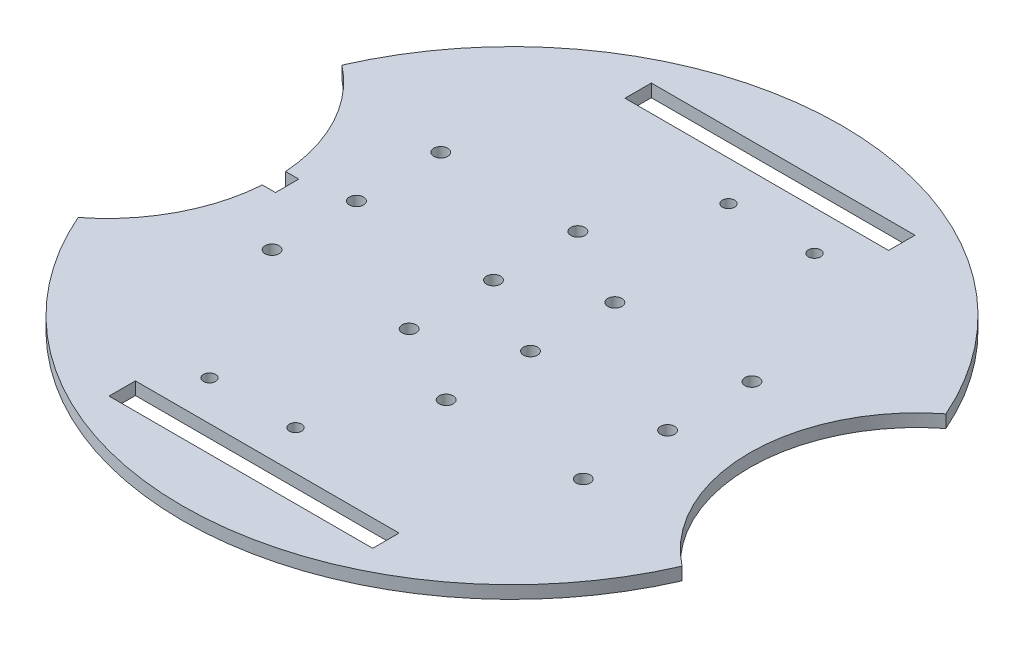
ISO-10303-21;
HEADER;
FILE_DESCRIPTION(('STEP AP214'),'2;1');
FILE_NAME('part.step','',(''),(''),'','','');
FILE_SCHEMA(('AUTOMOTIVE_DESIGN { 1 0 10303 214 1 1 1 1 }'));
ENDSEC;
DATA;
#1=APPLICATION_CONTEXT('core data for automotive mechanical design processes');
#2=APPLICATION_PROTOCOL_DEFINITION('international standard','automotive_design',2000,#1);
#3=PRODUCT_CONTEXT('',#1,'mechanical');
#4=PRODUCT('Part','Part','',(#3));
#5=PRODUCT_RELATED_PRODUCT_CATEGORY('part','',(#4));
#6=PRODUCT_DEFINITION_FORMATION('','',#4);
#7=PRODUCT_DEFINITION_CONTEXT('part definition',#1,'design');
#8=PRODUCT_DEFINITION('design','',#6,#7);
#9=PRODUCT_DEFINITION_SHAPE('','',#8);
#10=(LENGTH_UNIT() NAMED_UNIT(*) SI_UNIT(.MILLI.,.METRE.));
#11=(NAMED_UNIT(*) PLANE_ANGLE_UNIT() SI_UNIT($,.RADIAN.));
#12=(NAMED_UNIT(*) SI_UNIT($,.STERADIAN.) SOLID_ANGLE_UNIT());
#13=UNCERTAINTY_MEASURE_WITH_UNIT(LENGTH_MEASURE(1.E-05),#10,'distance_accuracy_value','');
#14=(GEOMETRIC_REPRESENTATION_CONTEXT(3) GLOBAL_UNCERTAINTY_ASSIGNED_CONTEXT((#13)) GLOBAL_UNIT_ASSIGNED_CONTEXT((#10,
#11,#12)) REPRESENTATION_CONTEXT('',''));
#15=CARTESIAN_POINT('',(0.,0.,0.));
#16=DIRECTION('',(0.,0.,1.));
#17=DIRECTION('',(1.,0.,0.));
#18=AXIS2_PLACEMENT_3D('',#15,#16,#17);
#19=CARTESIAN_POINT('',(0.,2.9,0.));
#20=DIRECTION('',(0.,1.,0.));
#21=DIRECTION('',(0.,0.,1.));
#22=AXIS2_PLACEMENT_3D('',#19,#20,#21);
#23=PLANE('',#22);
#24=DIRECTION('',(1.,0.,0.));
#25=VECTOR('',#24,1.);
#26=CARTESIAN_POINT('',(0.,2.9,-61.7092421050368));
#27=LINE('',#26,#25);
#28=CARTESIAN_POINT('',(-30.,2.9,-61.7092421050368));
#29=VERTEX_POINT('',#28);
#30=CARTESIAN_POINT('',(30.,2.9,-61.7092421050368));
#31=VERTEX_POINT('',#30);
#32=EDGE_CURVE('E183',#29,#31,#27,.T.);
#33=ORIENTED_EDGE('',*,*,#32,.T.);
#34=DIRECTION('',(0.,0.,1.));
#35=VECTOR('',#34,1.);
#36=CARTESIAN_POINT('',(30.0000000000001,2.9,0.));
#37=LINE('',#36,#35);
#38=CARTESIAN_POINT('',(30.,2.9,-55.7092421050368));
#39=VERTEX_POINT('',#38);
#40=EDGE_CURVE('E57',#31,#39,#37,.T.);
#41=ORIENTED_EDGE('',*,*,#40,.T.);
#42=DIRECTION('',(1.,0.,0.));
#43=VECTOR('',#42,1.);
#44=CARTESIAN_POINT('',(0.,2.9,-55.7092421050368));
#45=LINE('',#44,#43);
#46=CARTESIAN_POINT('',(-30.,2.9,-55.7092421050368));
#47=VERTEX_POINT('',#46);
#48=EDGE_CURVE('E189',#47,#39,#45,.T.);
#49=ORIENTED_EDGE('',*,*,#48,.F.);
#50=DIRECTION('',(0.,0.,1.));
#51=VECTOR('',#50,1.);
#52=CARTESIAN_POINT('',(-29.9999999999999,2.9,0.));
#53=LINE('',#52,#51);
#54=EDGE_CURVE('E186',#29,#47,#53,.T.);
#55=ORIENTED_EDGE('',*,*,#54,.F.);
#56=EDGE_LOOP('',(#33,#41,#49,#55));
#57=FACE_BOUND('',#56,.T.);
#58=CARTESIAN_POINT('',(-9.0999999999999,2.9,-24.0907578949632));
#59=DIRECTION('',(0.,1.,0.));
#60=DIRECTION('',(0.,0.,1.));
#61=AXIS2_PLACEMENT_3D('',#58,#59,#60);
#62=CIRCLE('',#61,1.6);
#63=CARTESIAN_POINT('',(-9.0999999999999,2.9,-22.4907578949632));
#64=VERTEX_POINT('',#63);
#65=EDGE_CURVE('E249',#64,#64,#62,.F.);
#66=ORIENTED_EDGE('',*,*,#65,.T.);
#67=EDGE_LOOP('',(#66));
#68=FACE_BOUND('',#67,.T.);
#69=CARTESIAN_POINT('',(-9.09999999999995,2.9,-4.89075789496318));
#70=DIRECTION('',(0.,1.,0.));
#71=DIRECTION('',(0.,0.,1.));
#72=AXIS2_PLACEMENT_3D('',#69,#70,#71);
#73=CIRCLE('',#72,1.6);
#74=CARTESIAN_POINT('',(-9.09999999999995,2.9,-3.29075789496318));
#75=VERTEX_POINT('',#74);
#76=EDGE_CURVE('E257',#75,#75,#73,.F.);
#77=ORIENTED_EDGE('',*,*,#76,.T.);
#78=EDGE_LOOP('',(#77));
#79=FACE_BOUND('',#78,.T.);
#80=CARTESIAN_POINT('',(9.10000000000001,2.9,-14.3092421050368));
#81=DIRECTION('',(0.,1.,0.));
#82=DIRECTION('',(0.,0.,1.));
#83=AXIS2_PLACEMENT_3D('',#80,#81,#82);
#84=CIRCLE('',#83,1.6);
#85=CARTESIAN_POINT('',(9.10000000000001,2.9,-12.7092421050368));
#86=VERTEX_POINT('',#85);
#87=EDGE_CURVE('E265',#86,#86,#84,.F.);
#88=ORIENTED_EDGE('',*,*,#87,.T.);
#89=EDGE_LOOP('',(#88));
#90=FACE_BOUND('',#89,.T.);
#91=CARTESIAN_POINT('',(40.3,2.9,-14.3092421050368));
#92=DIRECTION('',(0.,1.,0.));
#93=DIRECTION('',(0.,0.,1.));
#94=AXIS2_PLACEMENT_3D('',#91,#92,#93);
#95=CIRCLE('',#94,1.6);
#96=CARTESIAN_POINT('',(40.3,2.9,-12.7092421050368));
#97=VERTEX_POINT('',#96);
#98=EDGE_CURVE('E269',#97,#97,#95,.T.);
#99=ORIENTED_EDGE('',*,*,#98,.F.);
#100=EDGE_LOOP('',(#99));
#101=FACE_BOUND('',#100,.T.);
#102=CARTESIAN_POINT('',(40.3000000000002,2.9,4.89075789496318));
#103=DIRECTION('',(0.,1.,0.));
#104=DIRECTION('',(0.,0.,1.));
#105=AXIS2_PLACEMENT_3D('',#102,#103,#104);
#106=CIRCLE('',#105,1.6);
#107=CARTESIAN_POINT('',(40.3000000000002,2.9,6.49075789496318));
#108=VERTEX_POINT('',#107);
#109=EDGE_CURVE('E273',#108,#108,#106,.T.);
#110=ORIENTED_EDGE('',*,*,#109,.F.);
#111=EDGE_LOOP('',(#110));
#112=FACE_BOUND('',#111,.T.);
#113=CARTESIAN_POINT('',(40.3000000000004,2.9,24.0907578949632));
#114=DIRECTION('',(0.,1.,0.));
#115=DIRECTION('',(0.,0.,1.));
#116=AXIS2_PLACEMENT_3D('',#113,#114,#115);
#117=CIRCLE('',#116,1.6);
#118=CARTESIAN_POINT('',(40.3000000000004,2.9,25.6907578949632));
#119=VERTEX_POINT('',#118);
#120=EDGE_CURVE('E277',#119,#119,#117,.T.);
#121=ORIENTED_EDGE('',*,*,#120,.F.);
#122=EDGE_LOOP('',(#121));
#123=FACE_BOUND('',#122,.T.);
#124=CARTESIAN_POINT('',(9.09999999999963,2.9,24.0907578949632));
#125=DIRECTION('',(0.,1.,0.));
#126=DIRECTION('',(0.,0.,1.));
#127=AXIS2_PLACEMENT_3D('',#124,#125,#126);
#128=CIRCLE('',#127,1.6);
#129=CARTESIAN_POINT('',(9.09999999999963,2.9,25.6907578949632));
#130=VERTEX_POINT('',#129);
#131=EDGE_CURVE('E281',#130,#130,#128,.F.);
#132=ORIENTED_EDGE('',*,*,#131,.T.);
#133=EDGE_LOOP('',(#132));
#134=FACE_BOUND('',#133,.T.);
#135=CARTESIAN_POINT('',(9.09999999999982,2.9,4.89075789496319));
#136=DIRECTION('',(0.,1.,0.));
#137=DIRECTION('',(0.,0.,1.));
#138=AXIS2_PLACEMENT_3D('',#135,#136,#137);
#139=CIRCLE('',#138,1.6);
#140=CARTESIAN_POINT('',(9.09999999999982,2.9,6.49075789496319));
#141=VERTEX_POINT('',#140);
#142=EDGE_CURVE('E261',#141,#141,#139,.F.);
#143=ORIENTED_EDGE('',*,*,#142,.T.);
#144=EDGE_LOOP('',(#143));
#145=FACE_BOUND('',#144,.T.);
#146=CARTESIAN_POINT('',(-9.10000000000001,2.9,14.3092421050368));
#147=DIRECTION('',(0.,1.,0.));
#148=DIRECTION('',(0.,0.,1.));
#149=AXIS2_PLACEMENT_3D('',#146,#147,#148);
#150=CIRCLE('',#149,1.6);
#151=CARTESIAN_POINT('',(-9.10000000000001,2.9,15.9092421050368));
#152=VERTEX_POINT('',#151);
#153=EDGE_CURVE('E253',#152,#152,#150,.F.);
#154=ORIENTED_EDGE('',*,*,#153,.T.);
#155=EDGE_LOOP('',(#154));
#156=FACE_BOUND('',#155,.T.);
#157=CARTESIAN_POINT('',(-40.3000000000001,2.9,-24.0907578949632));
#158=DIRECTION('',(0.,1.,0.));
#159=DIRECTION('',(0.,0.,1.));
#160=AXIS2_PLACEMENT_3D('',#157,#158,#159);
#161=CIRCLE('',#160,1.6);
#162=CARTESIAN_POINT('',(-40.3000000000001,2.9,-22.4907578949632));
#163=VERTEX_POINT('',#162);
#164=EDGE_CURVE('E245',#163,#163,#161,.T.);
#165=ORIENTED_EDGE('',*,*,#164,.F.);
#166=EDGE_LOOP('',(#165));
#167=FACE_BOUND('',#166,.T.);
#168=CARTESIAN_POINT('',(-40.3000000000001,2.9,-4.89075789496317));
#169=DIRECTION('',(0.,1.,0.));
#170=DIRECTION('',(0.,0.,1.));
#171=AXIS2_PLACEMENT_3D('',#168,#169,#170);
#172=CIRCLE('',#171,1.6);
#173=CARTESIAN_POINT('',(-40.3000000000001,2.9,-3.29075789496317));
#174=VERTEX_POINT('',#173);
#175=EDGE_CURVE('E241',#174,#174,#172,.T.);
#176=ORIENTED_EDGE('',*,*,#175,.F.);
#177=EDGE_LOOP('',(#176));
#178=FACE_BOUND('',#177,.T.);
#179=CARTESIAN_POINT('',(-40.3,2.9,14.3092421050368));
#180=DIRECTION('',(0.,1.,0.));
#181=DIRECTION('',(0.,0.,1.));
#182=AXIS2_PLACEMENT_3D('',#179,#180,#181);
#183=CIRCLE('',#182,1.6);
#184=CARTESIAN_POINT('',(-40.3,2.9,15.9092421050368));
#185=VERTEX_POINT('',#184);
#186=EDGE_CURVE('E237',#185,#185,#183,.T.);
#187=ORIENTED_EDGE('',*,*,#186,.F.);
#188=EDGE_LOOP('',(#187));
#189=FACE_BOUND('',#188,.T.);
#190=CARTESIAN_POINT('',(-22.14,2.9,46.7092421050368));
#191=DIRECTION('',(0.,1.,0.));
#192=DIRECTION('',(0.,0.,1.));
#193=AXIS2_PLACEMENT_3D('',#190,#191,#192);
#194=CIRCLE('',#193,1.4);
#195=CARTESIAN_POINT('',(-22.14,2.9,48.1092421050368));
#196=VERTEX_POINT('',#195);
#197=EDGE_CURVE('E233',#196,#196,#194,.T.);
#198=ORIENTED_EDGE('',*,*,#197,.F.);
#199=EDGE_LOOP('',(#198));
#200=FACE_BOUND('',#199,.T.);
#201=CARTESIAN_POINT('',(-2.56,2.9,46.7092421050368));
#202=DIRECTION('',(0.,1.,0.));
#203=DIRECTION('',(0.,0.,1.));
#204=AXIS2_PLACEMENT_3D('',#201,#202,#203);
#205=CIRCLE('',#204,1.4);
#206=CARTESIAN_POINT('',(-2.56,2.9,48.1092421050368));
#207=VERTEX_POINT('',#206);
#208=EDGE_CURVE('E229',#207,#207,#205,.T.);
#209=ORIENTED_EDGE('',*,*,#208,.F.);
#210=EDGE_LOOP('',(#209));
#211=FACE_BOUND('',#210,.T.);
#212=CARTESIAN_POINT('',(22.14,2.9,-46.7092421050368));
#213=DIRECTION('',(0.,1.,0.));
#214=DIRECTION('',(0.,0.,1.));
#215=AXIS2_PLACEMENT_3D('',#212,#213,#214);
#216=CIRCLE('',#215,1.4);
#217=CARTESIAN_POINT('',(22.14,2.9,-45.3092421050368));
#218=VERTEX_POINT('',#217);
#219=EDGE_CURVE('E225',#218,#218,#216,.T.);
#220=ORIENTED_EDGE('',*,*,#219,.F.);
#221=EDGE_LOOP('',(#220));
#222=FACE_BOUND('',#221,.T.);
#223=CARTESIAN_POINT('',(2.56,2.9,-46.7092421050368));
#224=DIRECTION('',(0.,1.,0.));
#225=DIRECTION('',(0.,0.,1.));
#226=AXIS2_PLACEMENT_3D('',#223,#224,#225);
#227=CIRCLE('',#226,1.4);
#228=CARTESIAN_POINT('',(2.56,2.9,-45.3092421050368));
#229=VERTEX_POINT('',#228);
#230=EDGE_CURVE('E215',#229,#229,#227,.T.);
#231=ORIENTED_EDGE('',*,*,#230,.F.);
#232=EDGE_LOOP('',(#231));
#233=FACE_BOUND('',#232,.T.);
#234=DIRECTION('',(1.,0.,0.));
#235=VECTOR('',#234,1.);
#236=CARTESIAN_POINT('',(0.,2.9,55.7092421050368));
#237=LINE('',#236,#235);
#238=CARTESIAN_POINT('',(-30.,2.9,55.7092421050368));
#239=VERTEX_POINT('',#238);
#240=CARTESIAN_POINT('',(30.,2.9,55.7092421050368));
#241=VERTEX_POINT('',#240);
#242=EDGE_CURVE('E203',#239,#241,#237,.T.);
#243=ORIENTED_EDGE('',*,*,#242,.T.);
#244=DIRECTION('',(0.,0.,1.));
#245=VECTOR('',#244,1.);
#246=CARTESIAN_POINT('',(30.,2.9,0.));
#247=LINE('',#246,#245);
#248=CARTESIAN_POINT('',(30.,2.9,61.7092421050368));
#249=VERTEX_POINT('',#248);
#250=EDGE_CURVE('E195',#241,#249,#247,.T.);
#251=ORIENTED_EDGE('',*,*,#250,.T.);
#252=DIRECTION('',(1.,0.,0.));
#253=VECTOR('',#252,1.);
#254=CARTESIAN_POINT('',(0.,2.9,61.7092421050368));
#255=LINE('',#254,#253);
#256=CARTESIAN_POINT('',(-30.,2.9,61.7092421050368));
#257=VERTEX_POINT('',#256);
#258=EDGE_CURVE('E209',#257,#249,#255,.T.);
#259=ORIENTED_EDGE('',*,*,#258,.F.);
#260=DIRECTION('',(0.,0.,1.));
#261=VECTOR('',#260,1.);
#262=CARTESIAN_POINT('',(-29.9999999999999,2.9,0.));
#263=LINE('',#262,#261);
#264=EDGE_CURVE('E206',#239,#257,#263,.T.);
#265=ORIENTED_EDGE('',*,*,#264,.F.);
#266=EDGE_LOOP('',(#243,#251,#259,#265));
#267=FACE_BOUND('',#266,.T.);
#268=CARTESIAN_POINT('',(-92.1852034198443,2.9,0.));
#269=DIRECTION('',(0.,1.,0.));
#270=DIRECTION('',(0.,0.,1.));
#271=AXIS2_PLACEMENT_3D('',#268,#269,#270);
#272=CIRCLE('',#271,38.1);
#273=CARTESIAN_POINT('',(-68.7285012099368,2.9,-30.0232097124162));
#274=VERTEX_POINT('',#273);
#275=CARTESIAN_POINT('',(-54.1774739428024,2.9,-2.65));
#276=VERTEX_POINT('',#275);
#277=EDGE_CURVE('E293',#274,#276,#272,.F.);
#278=ORIENTED_EDGE('',*,*,#277,.T.);
#279=DIRECTION('',(1.,0.,0.));
#280=VECTOR('',#279,1.);
#281=CARTESIAN_POINT('',(0.,2.9,-2.65));
#282=LINE('',#281,#280);
#283=CARTESIAN_POINT('',(-51.1774739428024,2.9,-2.65));
#284=VERTEX_POINT('',#283);
#285=EDGE_CURVE('E168',#276,#284,#282,.T.);
#286=ORIENTED_EDGE('',*,*,#285,.T.);
#287=DIRECTION('',(0.,0.,1.));
#288=VECTOR('',#287,1.);
#289=CARTESIAN_POINT('',(-51.1774739428024,2.9,0.));
#290=LINE('',#289,#288);
#291=CARTESIAN_POINT('',(-51.1774739428024,2.9,2.65));
#292=VERTEX_POINT('',#291);
#293=EDGE_CURVE('E171',#284,#292,#290,.T.);
#294=ORIENTED_EDGE('',*,*,#293,.T.);
#295=DIRECTION('',(-1.,0.,0.));
#296=VECTOR('',#295,1.);
#297=CARTESIAN_POINT('',(0.,2.9,2.65));
#298=LINE('',#297,#296);
#299=CARTESIAN_POINT('',(-54.1774739428024,2.9,2.65));
#300=VERTEX_POINT('',#299);
#301=EDGE_CURVE('E160',#292,#300,#298,.T.);
#302=ORIENTED_EDGE('',*,*,#301,.T.);
#303=CARTESIAN_POINT('',(-68.7285012099368,2.9,30.0232097124162));
#304=VERTEX_POINT('',#303);
#305=EDGE_CURVE('E291',#300,#304,#272,.F.);
#306=ORIENTED_EDGE('',*,*,#305,.T.);
#307=CARTESIAN_POINT('',(0.,2.9,0.));
#308=DIRECTION('',(0.,1.,0.));
#309=DIRECTION('',(0.,0.,1.));
#310=AXIS2_PLACEMENT_3D('',#307,#308,#309);
#311=CIRCLE('',#310,75.);
#312=CARTESIAN_POINT('',(68.7285012099368,2.9,30.0232097124162));
#313=VERTEX_POINT('',#312);
#314=EDGE_CURVE('E303',#304,#313,#311,.T.);
#315=ORIENTED_EDGE('',*,*,#314,.T.);
#316=CARTESIAN_POINT('',(92.1852034198443,2.9,0.));
#317=DIRECTION('',(0.,1.,0.));
#318=DIRECTION('',(0.,0.,1.));
#319=AXIS2_PLACEMENT_3D('',#316,#317,#318);
#320=CIRCLE('',#319,38.1);
#321=CARTESIAN_POINT('',(68.7285012099368,2.9,-30.0232097124162));
#322=VERTEX_POINT('',#321);
#323=EDGE_CURVE('E285',#322,#313,#320,.T.);
#324=ORIENTED_EDGE('',*,*,#323,.F.);
#325=EDGE_CURVE('E306',#322,#274,#311,.T.);
#326=ORIENTED_EDGE('',*,*,#325,.T.);
#327=EDGE_LOOP('',(#278,#286,#294,#302,#306,#315,#324,#326));
#328=FACE_BOUND('',#327,.T.);
#329=ADVANCED_FACE('F34',(#57,#68,#79,#90,#101,#112,#123,#134,#145,#156,#167,#178,#189,#200,
#211,#222,#233,#267,#328),#23,.T.);
#330=CARTESIAN_POINT('',(0.,0.,0.));
#331=DIRECTION('',(0.,1.,0.));
#332=DIRECTION('',(0.,0.,1.));
#333=AXIS2_PLACEMENT_3D('',#330,#331,#332);
#334=PLANE('',#333);
#335=DIRECTION('',(0.,0.,1.));
#336=VECTOR('',#335,1.);
#337=CARTESIAN_POINT('',(30.0000000000001,0.,0.));
#338=LINE('',#337,#336);
#339=CARTESIAN_POINT('',(30.,0.,-61.7092421050368));
#340=VERTEX_POINT('',#339);
#341=CARTESIAN_POINT('',(30.,0.,-55.7092421050368));
#342=VERTEX_POINT('',#341);
#343=EDGE_CURVE('E11',#340,#342,#338,.T.);
#344=ORIENTED_EDGE('',*,*,#343,.F.);
#345=DIRECTION('',(1.,0.,0.));
#346=VECTOR('',#345,1.);
#347=CARTESIAN_POINT('',(0.,0.,-61.7092421050368));
#348=LINE('',#347,#346);
#349=CARTESIAN_POINT('',(-30.,0.,-61.7092421050368));
#350=VERTEX_POINT('',#349);
#351=EDGE_CURVE('E358',#350,#340,#348,.T.);
#352=ORIENTED_EDGE('',*,*,#351,.F.);
#353=DIRECTION('',(0.,0.,1.));
#354=VECTOR('',#353,1.);
#355=CARTESIAN_POINT('',(-29.9999999999999,0.,0.));
#356=LINE('',#355,#354);
#357=CARTESIAN_POINT('',(-30.,0.,-55.7092421050368));
#358=VERTEX_POINT('',#357);
#359=EDGE_CURVE('E360',#350,#358,#356,.T.);
#360=ORIENTED_EDGE('',*,*,#359,.T.);
#361=DIRECTION('',(1.,0.,0.));
#362=VECTOR('',#361,1.);
#363=CARTESIAN_POINT('',(0.,0.,-55.7092421050368));
#364=LINE('',#363,#362);
#365=EDGE_CURVE('E42',#358,#342,#364,.T.);
#366=ORIENTED_EDGE('',*,*,#365,.T.);
#367=EDGE_LOOP('',(#344,#352,#360,#366));
#368=FACE_BOUND('',#367,.T.);
#369=CARTESIAN_POINT('',(-9.0999999999999,0.,-24.0907578949632));
#370=DIRECTION('',(0.,1.,0.));
#371=DIRECTION('',(0.,0.,1.));
#372=AXIS2_PLACEMENT_3D('',#369,#370,#371);
#373=CIRCLE('',#372,1.6);
#374=CARTESIAN_POINT('',(-9.0999999999999,0.,-22.4907578949632));
#375=VERTEX_POINT('',#374);
#376=EDGE_CURVE('E252',#375,#375,#373,.F.);
#377=ORIENTED_EDGE('',*,*,#376,.F.);
#378=EDGE_LOOP('',(#377));
#379=FACE_BOUND('',#378,.T.);
#380=CARTESIAN_POINT('',(-9.09999999999995,0.,-4.89075789496318));
#381=DIRECTION('',(0.,1.,0.));
#382=DIRECTION('',(0.,0.,1.));
#383=AXIS2_PLACEMENT_3D('',#380,#381,#382);
#384=CIRCLE('',#383,1.6);
#385=CARTESIAN_POINT('',(-9.09999999999995,0.,-3.29075789496318));
#386=VERTEX_POINT('',#385);
#387=EDGE_CURVE('E260',#386,#386,#384,.F.);
#388=ORIENTED_EDGE('',*,*,#387,.F.);
#389=EDGE_LOOP('',(#388));
#390=FACE_BOUND('',#389,.T.);
#391=CARTESIAN_POINT('',(9.10000000000001,0.,-14.3092421050368));
#392=DIRECTION('',(0.,1.,0.));
#393=DIRECTION('',(0.,0.,1.));
#394=AXIS2_PLACEMENT_3D('',#391,#392,#393);
#395=CIRCLE('',#394,1.6);
#396=CARTESIAN_POINT('',(9.10000000000001,0.,-12.7092421050368));
#397=VERTEX_POINT('',#396);
#398=EDGE_CURVE('E268',#397,#397,#395,.F.);
#399=ORIENTED_EDGE('',*,*,#398,.F.);
#400=EDGE_LOOP('',(#399));
#401=FACE_BOUND('',#400,.T.);
#402=CARTESIAN_POINT('',(40.3,0.,-14.3092421050368));
#403=DIRECTION('',(0.,1.,0.));
#404=DIRECTION('',(0.,0.,1.));
#405=AXIS2_PLACEMENT_3D('',#402,#403,#404);
#406=CIRCLE('',#405,1.6);
#407=CARTESIAN_POINT('',(40.3,0.,-12.7092421050368));
#408=VERTEX_POINT('',#407);
#409=EDGE_CURVE('E272',#408,#408,#406,.T.);
#410=ORIENTED_EDGE('',*,*,#409,.T.);
#411=EDGE_LOOP('',(#410));
#412=FACE_BOUND('',#411,.T.);
#413=CARTESIAN_POINT('',(40.3000000000002,0.,4.89075789496318));
#414=DIRECTION('',(0.,1.,0.));
#415=DIRECTION('',(0.,0.,1.));
#416=AXIS2_PLACEMENT_3D('',#413,#414,#415);
#417=CIRCLE('',#416,1.6);
#418=CARTESIAN_POINT('',(40.3000000000002,0.,6.49075789496318));
#419=VERTEX_POINT('',#418);
#420=EDGE_CURVE('E276',#419,#419,#417,.T.);
#421=ORIENTED_EDGE('',*,*,#420,.T.);
#422=EDGE_LOOP('',(#421));
#423=FACE_BOUND('',#422,.T.);
#424=CARTESIAN_POINT('',(40.3000000000004,0.,24.0907578949632));
#425=DIRECTION('',(0.,1.,0.));
#426=DIRECTION('',(0.,0.,1.));
#427=AXIS2_PLACEMENT_3D('',#424,#425,#426);
#428=CIRCLE('',#427,1.6);
#429=CARTESIAN_POINT('',(40.3000000000004,0.,25.6907578949632));
#430=VERTEX_POINT('',#429);
#431=EDGE_CURVE('E280',#430,#430,#428,.T.);
#432=ORIENTED_EDGE('',*,*,#431,.T.);
#433=EDGE_LOOP('',(#432));
#434=FACE_BOUND('',#433,.T.);
#435=CARTESIAN_POINT('',(9.09999999999963,0.,24.0907578949632));
#436=DIRECTION('',(0.,1.,0.));
#437=DIRECTION('',(0.,0.,1.));
#438=AXIS2_PLACEMENT_3D('',#435,#436,#437);
#439=CIRCLE('',#438,1.6);
#440=CARTESIAN_POINT('',(9.09999999999963,0.,25.6907578949632));
#441=VERTEX_POINT('',#440);
#442=EDGE_CURVE('E284',#441,#441,#439,.F.);
#443=ORIENTED_EDGE('',*,*,#442,.F.);
#444=EDGE_LOOP('',(#443));
#445=FACE_BOUND('',#444,.T.);
#446=CARTESIAN_POINT('',(9.09999999999982,0.,4.89075789496319));
#447=DIRECTION('',(0.,1.,0.));
#448=DIRECTION('',(0.,0.,1.));
#449=AXIS2_PLACEMENT_3D('',#446,#447,#448);
#450=CIRCLE('',#449,1.6);
#451=CARTESIAN_POINT('',(9.09999999999982,0.,6.49075789496319));
#452=VERTEX_POINT('',#451);
#453=EDGE_CURVE('E264',#452,#452,#450,.F.);
#454=ORIENTED_EDGE('',*,*,#453,.F.);
#455=EDGE_LOOP('',(#454));
#456=FACE_BOUND('',#455,.T.);
#457=CARTESIAN_POINT('',(-9.10000000000001,0.,14.3092421050368));
#458=DIRECTION('',(0.,1.,0.));
#459=DIRECTION('',(0.,0.,1.));
#460=AXIS2_PLACEMENT_3D('',#457,#458,#459);
#461=CIRCLE('',#460,1.6);
#462=CARTESIAN_POINT('',(-9.10000000000001,0.,15.9092421050368));
#463=VERTEX_POINT('',#462);
#464=EDGE_CURVE('E256',#463,#463,#461,.F.);
#465=ORIENTED_EDGE('',*,*,#464,.F.);
#466=EDGE_LOOP('',(#465));
#467=FACE_BOUND('',#466,.T.);
#468=CARTESIAN_POINT('',(-40.3000000000001,0.,-24.0907578949632));
#469=DIRECTION('',(0.,1.,0.));
#470=DIRECTION('',(0.,0.,1.));
#471=AXIS2_PLACEMENT_3D('',#468,#469,#470);
#472=CIRCLE('',#471,1.6);
#473=CARTESIAN_POINT('',(-40.3000000000001,0.,-22.4907578949632));
#474=VERTEX_POINT('',#473);
#475=EDGE_CURVE('E248',#474,#474,#472,.T.);
#476=ORIENTED_EDGE('',*,*,#475,.T.);
#477=EDGE_LOOP('',(#476));
#478=FACE_BOUND('',#477,.T.);
#479=CARTESIAN_POINT('',(-40.3000000000001,0.,-4.89075789496317));
#480=DIRECTION('',(0.,1.,0.));
#481=DIRECTION('',(0.,0.,1.));
#482=AXIS2_PLACEMENT_3D('',#479,#480,#481);
#483=CIRCLE('',#482,1.6);
#484=CARTESIAN_POINT('',(-40.3000000000001,0.,-3.29075789496317));
#485=VERTEX_POINT('',#484);
#486=EDGE_CURVE('E244',#485,#485,#483,.T.);
#487=ORIENTED_EDGE('',*,*,#486,.T.);
#488=EDGE_LOOP('',(#487));
#489=FACE_BOUND('',#488,.T.);
#490=CARTESIAN_POINT('',(-40.3,0.,14.3092421050368));
#491=DIRECTION('',(0.,1.,0.));
#492=DIRECTION('',(0.,0.,1.));
#493=AXIS2_PLACEMENT_3D('',#490,#491,#492);
#494=CIRCLE('',#493,1.6);
#495=CARTESIAN_POINT('',(-40.3,0.,15.9092421050368));
#496=VERTEX_POINT('',#495);
#497=EDGE_CURVE('E240',#496,#496,#494,.T.);
#498=ORIENTED_EDGE('',*,*,#497,.T.);
#499=EDGE_LOOP('',(#498));
#500=FACE_BOUND('',#499,.T.);
#501=CARTESIAN_POINT('',(-22.14,0.,46.7092421050368));
#502=DIRECTION('',(0.,1.,0.));
#503=DIRECTION('',(0.,0.,1.));
#504=AXIS2_PLACEMENT_3D('',#501,#502,#503);
#505=CIRCLE('',#504,1.4);
#506=CARTESIAN_POINT('',(-22.14,0.,48.1092421050368));
#507=VERTEX_POINT('',#506);
#508=EDGE_CURVE('E236',#507,#507,#505,.T.);
#509=ORIENTED_EDGE('',*,*,#508,.T.);
#510=EDGE_LOOP('',(#509));
#511=FACE_BOUND('',#510,.T.);
#512=CARTESIAN_POINT('',(-2.56,0.,46.7092421050368));
#513=DIRECTION('',(0.,1.,0.));
#514=DIRECTION('',(0.,0.,1.));
#515=AXIS2_PLACEMENT_3D('',#512,#513,#514);
#516=CIRCLE('',#515,1.4);
#517=CARTESIAN_POINT('',(-2.56,0.,48.1092421050368));
#518=VERTEX_POINT('',#517);
#519=EDGE_CURVE('E232',#518,#518,#516,.T.);
#520=ORIENTED_EDGE('',*,*,#519,.T.);
#521=EDGE_LOOP('',(#520));
#522=FACE_BOUND('',#521,.T.);
#523=CARTESIAN_POINT('',(22.14,0.,-46.7092421050368));
#524=DIRECTION('',(0.,1.,0.));
#525=DIRECTION('',(0.,0.,1.));
#526=AXIS2_PLACEMENT_3D('',#523,#524,#525);
#527=CIRCLE('',#526,1.4);
#528=CARTESIAN_POINT('',(22.14,0.,-45.3092421050368));
#529=VERTEX_POINT('',#528);
#530=EDGE_CURVE('E228',#529,#529,#527,.T.);
#531=ORIENTED_EDGE('',*,*,#530,.T.);
#532=EDGE_LOOP('',(#531));
#533=FACE_BOUND('',#532,.T.);
#534=CARTESIAN_POINT('',(2.56,0.,-46.7092421050368));
#535=DIRECTION('',(0.,1.,0.));
#536=DIRECTION('',(0.,0.,1.));
#537=AXIS2_PLACEMENT_3D('',#534,#535,#536);
#538=CIRCLE('',#537,1.4);
#539=CARTESIAN_POINT('',(2.56,0.,-45.3092421050368));
#540=VERTEX_POINT('',#539);
#541=EDGE_CURVE('E224',#540,#540,#538,.T.);
#542=ORIENTED_EDGE('',*,*,#541,.T.);
#543=EDGE_LOOP('',(#542));
#544=FACE_BOUND('',#543,.T.);
#545=DIRECTION('',(0.,0.,1.));
#546=VECTOR('',#545,1.);
#547=CARTESIAN_POINT('',(30.,0.,0.));
#548=LINE('',#547,#546);
#549=CARTESIAN_POINT('',(30.,0.,55.7092421050368));
#550=VERTEX_POINT('',#549);
#551=CARTESIAN_POINT('',(30.,0.,61.7092421050368));
#552=VERTEX_POINT('',#551);
#553=EDGE_CURVE('E356',#550,#552,#548,.T.);
#554=ORIENTED_EDGE('',*,*,#553,.F.);
#555=DIRECTION('',(1.,0.,0.));
#556=VECTOR('',#555,1.);
#557=CARTESIAN_POINT('',(0.,0.,55.7092421050368));
#558=LINE('',#557,#556);
#559=CARTESIAN_POINT('',(-30.,0.,55.7092421050368));
#560=VERTEX_POINT('',#559);
#561=EDGE_CURVE('E316',#560,#550,#558,.T.);
#562=ORIENTED_EDGE('',*,*,#561,.F.);
#563=DIRECTION('',(0.,0.,1.));
#564=VECTOR('',#563,1.);
#565=CARTESIAN_POINT('',(-29.9999999999999,0.,0.));
#566=LINE('',#565,#564);
#567=CARTESIAN_POINT('',(-30.,0.,61.7092421050368));
#568=VERTEX_POINT('',#567);
#569=EDGE_CURVE('E350',#560,#568,#566,.T.);
#570=ORIENTED_EDGE('',*,*,#569,.T.);
#571=DIRECTION('',(1.,0.,0.));
#572=VECTOR('',#571,1.);
#573=CARTESIAN_POINT('',(0.,0.,61.7092421050368));
#574=LINE('',#573,#572);
#575=EDGE_CURVE('E353',#568,#552,#574,.T.);
#576=ORIENTED_EDGE('',*,*,#575,.T.);
#577=EDGE_LOOP('',(#554,#562,#570,#576));
#578=FACE_BOUND('',#577,.T.);
#579=DIRECTION('',(1.,0.,0.));
#580=VECTOR('',#579,1.);
#581=CARTESIAN_POINT('',(0.,0.,-2.65));
#582=LINE('',#581,#580);
#583=CARTESIAN_POINT('',(-54.1774739428024,0.,-2.65));
#584=VERTEX_POINT('',#583);
#585=CARTESIAN_POINT('',(-51.1774739428024,0.,-2.65));
#586=VERTEX_POINT('',#585);
#587=EDGE_CURVE('E156',#584,#586,#582,.T.);
#588=ORIENTED_EDGE('',*,*,#587,.F.);
#589=CARTESIAN_POINT('',(-92.1852034198443,0.,0.));
#590=DIRECTION('',(0.,1.,0.));
#591=DIRECTION('',(0.,0.,1.));
#592=AXIS2_PLACEMENT_3D('',#589,#590,#591);
#593=CIRCLE('',#592,38.1);
#594=CARTESIAN_POINT('',(-68.7285012099368,0.,-30.0232097124162));
#595=VERTEX_POINT('',#594);
#596=EDGE_CURVE('E310',#595,#584,#593,.F.);
#597=ORIENTED_EDGE('',*,*,#596,.F.);
#598=CARTESIAN_POINT('',(0.,0.,0.));
#599=DIRECTION('',(0.,1.,0.));
#600=DIRECTION('',(0.,0.,1.));
#601=AXIS2_PLACEMENT_3D('',#598,#599,#600);
#602=CIRCLE('',#601,75.);
#603=CARTESIAN_POINT('',(68.7285012099368,0.,-30.0232097124162));
#604=VERTEX_POINT('',#603);
#605=EDGE_CURVE('E300',#604,#595,#602,.T.);
#606=ORIENTED_EDGE('',*,*,#605,.F.);
#607=CARTESIAN_POINT('',(92.1852034198443,0.,0.));
#608=DIRECTION('',(0.,1.,0.));
#609=DIRECTION('',(0.,0.,1.));
#610=AXIS2_PLACEMENT_3D('',#607,#608,#609);
#611=CIRCLE('',#610,38.1);
#612=CARTESIAN_POINT('',(68.7285012099368,0.,30.0232097124162));
#613=VERTEX_POINT('',#612);
#614=EDGE_CURVE('E313',#604,#613,#611,.T.);
#615=ORIENTED_EDGE('',*,*,#614,.T.);
#616=CARTESIAN_POINT('',(-68.7285012099368,0.,30.0232097124162));
#617=VERTEX_POINT('',#616);
#618=EDGE_CURVE('E307',#617,#613,#602,.T.);
#619=ORIENTED_EDGE('',*,*,#618,.F.);
#620=CARTESIAN_POINT('',(-54.1774739428024,0.,2.65));
#621=VERTEX_POINT('',#620);
#622=EDGE_CURVE('E167',#621,#617,#593,.F.);
#623=ORIENTED_EDGE('',*,*,#622,.F.);
#624=DIRECTION('',(-1.,0.,0.));
#625=VECTOR('',#624,1.);
#626=CARTESIAN_POINT('',(0.,0.,2.65));
#627=LINE('',#626,#625);
#628=CARTESIAN_POINT('',(-51.1774739428024,0.,2.65));
#629=VERTEX_POINT('',#628);
#630=EDGE_CURVE('E49',#629,#621,#627,.T.);
#631=ORIENTED_EDGE('',*,*,#630,.F.);
#632=DIRECTION('',(0.,0.,1.));
#633=VECTOR('',#632,1.);
#634=CARTESIAN_POINT('',(-51.1774739428024,0.,0.));
#635=LINE('',#634,#633);
#636=EDGE_CURVE('E148',#586,#629,#635,.T.);
#637=ORIENTED_EDGE('',*,*,#636,.F.);
#638=EDGE_LOOP('',(#588,#597,#606,#615,#619,#623,#631,#637));
#639=FACE_BOUND('',#638,.T.);
#640=ADVANCED_FACE('F165',(#368,#379,#390,#401,#412,#423,#434,#445,#456,#467,#478,#489,#500,
#511,#522,#533,#544,#578,#639),#334,.F.);
#641=CARTESIAN_POINT('',(-92.1852034198443,-7.1,0.));
#642=DIRECTION('',(0.,1.,0.));
#643=DIRECTION('',(0.,0.,1.));
#644=AXIS2_PLACEMENT_3D('',#641,#642,#643);
#645=CYLINDRICAL_SURFACE('',#644,38.1);
#646=ORIENTED_EDGE('',*,*,#596,.T.);
#647=DIRECTION('',(0.,1.,0.));
#648=VECTOR('',#647,1.);
#649=CARTESIAN_POINT('',(-54.1774739428024,0.,-2.65));
#650=LINE('',#649,#648);
#651=EDGE_CURVE('E177',#584,#276,#650,.T.);
#652=ORIENTED_EDGE('',*,*,#651,.T.);
#653=ORIENTED_EDGE('',*,*,#277,.F.);
#654=DIRECTION('',(0.,1.,0.));
#655=VECTOR('',#654,1.);
#656=CARTESIAN_POINT('',(-68.7285012099368,-7.1,-30.0232097124162));
#657=LINE('',#656,#655);
#658=EDGE_CURVE('E296',#595,#274,#657,.T.);
#659=ORIENTED_EDGE('',*,*,#658,.F.);
#660=EDGE_LOOP('',(#646,#652,#653,#659));
#661=FACE_BOUND('',#660,.T.);
#662=ADVANCED_FACE('F400',(#661),#645,.F.);
#663=ORIENTED_EDGE('',*,*,#305,.F.);
#664=DIRECTION('',(0.,1.,0.));
#665=VECTOR('',#664,1.);
#666=CARTESIAN_POINT('',(-54.1774739428024,0.,2.65));
#667=LINE('',#666,#665);
#668=EDGE_CURVE('E162',#621,#300,#667,.T.);
#669=ORIENTED_EDGE('',*,*,#668,.F.);
#670=ORIENTED_EDGE('',*,*,#622,.T.);
#671=DIRECTION('',(0.,1.,0.));
#672=VECTOR('',#671,1.);
#673=CARTESIAN_POINT('',(-68.7285012099368,-7.1,30.0232097124162));
#674=LINE('',#673,#672);
#675=EDGE_CURVE('E297',#617,#304,#674,.T.);
#676=ORIENTED_EDGE('',*,*,#675,.T.);
#677=EDGE_LOOP('',(#663,#669,#670,#676));
#678=FACE_BOUND('',#677,.T.);
#679=ADVANCED_FACE('F404',(#678),#645,.F.);
#680=CARTESIAN_POINT('',(0.,2.9,0.));
#681=DIRECTION('',(0.,-1.,0.));
#682=DIRECTION('',(0.,0.,-1.));
#683=AXIS2_PLACEMENT_3D('',#680,#681,#682);
#684=CYLINDRICAL_SURFACE('',#683,75.);
#685=ORIENTED_EDGE('',*,*,#618,.T.);
#686=DIRECTION('',(0.,1.,0.));
#687=VECTOR('',#686,1.);
#688=CARTESIAN_POINT('',(68.7285012099368,-7.1,30.0232097124162));
#689=LINE('',#688,#687);
#690=EDGE_CURVE('E288',#613,#313,#689,.T.);
#691=ORIENTED_EDGE('',*,*,#690,.T.);
#692=ORIENTED_EDGE('',*,*,#314,.F.);
#693=ORIENTED_EDGE('',*,*,#675,.F.);
#694=EDGE_LOOP('',(#685,#691,#692,#693));
#695=FACE_BOUND('',#694,.T.);
#696=ADVANCED_FACE('F512',(#695),#684,.T.);
#697=ORIENTED_EDGE('',*,*,#325,.F.);
#698=DIRECTION('',(0.,1.,0.));
#699=VECTOR('',#698,1.);
#700=CARTESIAN_POINT('',(68.7285012099368,-7.1,-30.0232097124162));
#701=LINE('',#700,#699);
#702=EDGE_CURVE('E287',#604,#322,#701,.T.);
#703=ORIENTED_EDGE('',*,*,#702,.F.);
#704=ORIENTED_EDGE('',*,*,#605,.T.);
#705=ORIENTED_EDGE('',*,*,#658,.T.);
#706=EDGE_LOOP('',(#697,#703,#704,#705));
#707=FACE_BOUND('',#706,.T.);
#708=ADVANCED_FACE('F36',(#707),#684,.T.);
#709=CARTESIAN_POINT('',(92.1852034198443,-7.1,0.));
#710=DIRECTION('',(0.,1.,0.));
#711=DIRECTION('',(0.,0.,1.));
#712=AXIS2_PLACEMENT_3D('',#709,#710,#711);
#713=CYLINDRICAL_SURFACE('',#712,38.1);
#714=ORIENTED_EDGE('',*,*,#702,.T.);
#715=ORIENTED_EDGE('',*,*,#323,.T.);
#716=ORIENTED_EDGE('',*,*,#690,.F.);
#717=ORIENTED_EDGE('',*,*,#614,.F.);
#718=EDGE_LOOP('',(#714,#715,#716,#717));
#719=FACE_BOUND('',#718,.T.);
#720=ADVANCED_FACE('F406',(#719),#713,.F.);
#721=CARTESIAN_POINT('',(9.09999999999963,-7.1,24.0907578949632));
#722=DIRECTION('',(0.,1.,0.));
#723=DIRECTION('',(0.,0.,1.));
#724=AXIS2_PLACEMENT_3D('',#721,#722,#723);
#725=CYLINDRICAL_SURFACE('',#724,1.6);
#726=ORIENTED_EDGE('',*,*,#131,.F.);
#727=EDGE_LOOP('',(#726));
#728=FACE_BOUND('',#727,.T.);
#729=ORIENTED_EDGE('',*,*,#442,.T.);
#730=EDGE_LOOP('',(#729));
#731=FACE_BOUND('',#730,.T.);
#732=ADVANCED_FACE('F409',(#728,#731),#725,.F.);
#733=CARTESIAN_POINT('',(40.3000000000004,-7.1,24.0907578949632));
#734=DIRECTION('',(0.,1.,0.));
#735=DIRECTION('',(0.,0.,1.));
#736=AXIS2_PLACEMENT_3D('',#733,#734,#735);
#737=CYLINDRICAL_SURFACE('',#736,1.6);
#738=ORIENTED_EDGE('',*,*,#120,.T.);
#739=EDGE_LOOP('',(#738));
#740=FACE_BOUND('',#739,.T.);
#741=ORIENTED_EDGE('',*,*,#431,.F.);
#742=EDGE_LOOP('',(#741));
#743=FACE_BOUND('',#742,.T.);
#744=ADVANCED_FACE('F413',(#740,#743),#737,.F.);
#745=CARTESIAN_POINT('',(40.3000000000002,-7.1,4.89075789496318));
#746=DIRECTION('',(0.,1.,0.));
#747=DIRECTION('',(0.,0.,1.));
#748=AXIS2_PLACEMENT_3D('',#745,#746,#747);
#749=CYLINDRICAL_SURFACE('',#748,1.6);
#750=ORIENTED_EDGE('',*,*,#109,.T.);
#751=EDGE_LOOP('',(#750));
#752=FACE_BOUND('',#751,.T.);
#753=ORIENTED_EDGE('',*,*,#420,.F.);
#754=EDGE_LOOP('',(#753));
#755=FACE_BOUND('',#754,.T.);
#756=ADVANCED_FACE('F417',(#752,#755),#749,.F.);
#757=CARTESIAN_POINT('',(40.3,-7.1,-14.3092421050368));
#758=DIRECTION('',(0.,1.,0.));
#759=DIRECTION('',(0.,0.,1.));
#760=AXIS2_PLACEMENT_3D('',#757,#758,#759);
#761=CYLINDRICAL_SURFACE('',#760,1.6);
#762=ORIENTED_EDGE('',*,*,#98,.T.);
#763=EDGE_LOOP('',(#762));
#764=FACE_BOUND('',#763,.T.);
#765=ORIENTED_EDGE('',*,*,#409,.F.);
#766=EDGE_LOOP('',(#765));
#767=FACE_BOUND('',#766,.T.);
#768=ADVANCED_FACE('F421',(#764,#767),#761,.F.);
#769=CARTESIAN_POINT('',(9.10000000000001,-7.1,-14.3092421050368));
#770=DIRECTION('',(0.,1.,0.));
#771=DIRECTION('',(0.,0.,1.));
#772=AXIS2_PLACEMENT_3D('',#769,#770,#771);
#773=CYLINDRICAL_SURFACE('',#772,1.6);
#774=ORIENTED_EDGE('',*,*,#87,.F.);
#775=EDGE_LOOP('',(#774));
#776=FACE_BOUND('',#775,.T.);
#777=ORIENTED_EDGE('',*,*,#398,.T.);
#778=EDGE_LOOP('',(#777));
#779=FACE_BOUND('',#778,.T.);
#780=ADVANCED_FACE('F425',(#776,#779),#773,.F.);
#781=CARTESIAN_POINT('',(9.09999999999982,-7.1,4.89075789496319));
#782=DIRECTION('',(0.,1.,0.));
#783=DIRECTION('',(0.,0.,1.));
#784=AXIS2_PLACEMENT_3D('',#781,#782,#783);
#785=CYLINDRICAL_SURFACE('',#784,1.6);
#786=ORIENTED_EDGE('',*,*,#142,.F.);
#787=EDGE_LOOP('',(#786));
#788=FACE_BOUND('',#787,.T.);
#789=ORIENTED_EDGE('',*,*,#453,.T.);
#790=EDGE_LOOP('',(#789));
#791=FACE_BOUND('',#790,.T.);
#792=ADVANCED_FACE('F429',(#788,#791),#785,.F.);
#793=CARTESIAN_POINT('',(-9.09999999999995,-7.1,-4.89075789496318));
#794=DIRECTION('',(0.,1.,0.));
#795=DIRECTION('',(0.,0.,1.));
#796=AXIS2_PLACEMENT_3D('',#793,#794,#795);
#797=CYLINDRICAL_SURFACE('',#796,1.6);
#798=ORIENTED_EDGE('',*,*,#76,.F.);
#799=EDGE_LOOP('',(#798));
#800=FACE_BOUND('',#799,.T.);
#801=ORIENTED_EDGE('',*,*,#387,.T.);
#802=EDGE_LOOP('',(#801));
#803=FACE_BOUND('',#802,.T.);
#804=ADVANCED_FACE('F433',(#800,#803),#797,.F.);
#805=CARTESIAN_POINT('',(-9.10000000000001,-7.1,14.3092421050368));
#806=DIRECTION('',(0.,1.,0.));
#807=DIRECTION('',(0.,0.,1.));
#808=AXIS2_PLACEMENT_3D('',#805,#806,#807);
#809=CYLINDRICAL_SURFACE('',#808,1.6);
#810=ORIENTED_EDGE('',*,*,#153,.F.);
#811=EDGE_LOOP('',(#810));
#812=FACE_BOUND('',#811,.T.);
#813=ORIENTED_EDGE('',*,*,#464,.T.);
#814=EDGE_LOOP('',(#813));
#815=FACE_BOUND('',#814,.T.);
#816=ADVANCED_FACE('F437',(#812,#815),#809,.F.);
#817=CARTESIAN_POINT('',(-9.0999999999999,-7.1,-24.0907578949632));
#818=DIRECTION('',(0.,1.,0.));
#819=DIRECTION('',(0.,0.,1.));
#820=AXIS2_PLACEMENT_3D('',#817,#818,#819);
#821=CYLINDRICAL_SURFACE('',#820,1.6);
#822=ORIENTED_EDGE('',*,*,#65,.F.);
#823=EDGE_LOOP('',(#822));
#824=FACE_BOUND('',#823,.T.);
#825=ORIENTED_EDGE('',*,*,#376,.T.);
#826=EDGE_LOOP('',(#825));
#827=FACE_BOUND('',#826,.T.);
#828=ADVANCED_FACE('F441',(#824,#827),#821,.F.);
#829=CARTESIAN_POINT('',(-40.3000000000001,-7.1,-24.0907578949632));
#830=DIRECTION('',(0.,1.,0.));
#831=DIRECTION('',(0.,0.,1.));
#832=AXIS2_PLACEMENT_3D('',#829,#830,#831);
#833=CYLINDRICAL_SURFACE('',#832,1.6);
#834=ORIENTED_EDGE('',*,*,#164,.T.);
#835=EDGE_LOOP('',(#834));
#836=FACE_BOUND('',#835,.T.);
#837=ORIENTED_EDGE('',*,*,#475,.F.);
#838=EDGE_LOOP('',(#837));
#839=FACE_BOUND('',#838,.T.);
#840=ADVANCED_FACE('F445',(#836,#839),#833,.F.);
#841=CARTESIAN_POINT('',(-40.3000000000001,-7.1,-4.89075789496317));
#842=DIRECTION('',(0.,1.,0.));
#843=DIRECTION('',(0.,0.,1.));
#844=AXIS2_PLACEMENT_3D('',#841,#842,#843);
#845=CYLINDRICAL_SURFACE('',#844,1.6);
#846=ORIENTED_EDGE('',*,*,#175,.T.);
#847=EDGE_LOOP('',(#846));
#848=FACE_BOUND('',#847,.T.);
#849=ORIENTED_EDGE('',*,*,#486,.F.);
#850=EDGE_LOOP('',(#849));
#851=FACE_BOUND('',#850,.T.);
#852=ADVANCED_FACE('F449',(#848,#851),#845,.F.);
#853=CARTESIAN_POINT('',(-40.3,-7.1,14.3092421050368));
#854=DIRECTION('',(0.,1.,0.));
#855=DIRECTION('',(0.,0.,1.));
#856=AXIS2_PLACEMENT_3D('',#853,#854,#855);
#857=CYLINDRICAL_SURFACE('',#856,1.6);
#858=ORIENTED_EDGE('',*,*,#186,.T.);
#859=EDGE_LOOP('',(#858));
#860=FACE_BOUND('',#859,.T.);
#861=ORIENTED_EDGE('',*,*,#497,.F.);
#862=EDGE_LOOP('',(#861));
#863=FACE_BOUND('',#862,.T.);
#864=ADVANCED_FACE('F453',(#860,#863),#857,.F.);
#865=CARTESIAN_POINT('',(-22.14,-7.1,46.7092421050368));
#866=DIRECTION('',(0.,1.,0.));
#867=DIRECTION('',(0.,0.,1.));
#868=AXIS2_PLACEMENT_3D('',#865,#866,#867);
#869=CYLINDRICAL_SURFACE('',#868,1.4);
#870=ORIENTED_EDGE('',*,*,#197,.T.);
#871=EDGE_LOOP('',(#870));
#872=FACE_BOUND('',#871,.T.);
#873=ORIENTED_EDGE('',*,*,#508,.F.);
#874=EDGE_LOOP('',(#873));
#875=FACE_BOUND('',#874,.T.);
#876=ADVANCED_FACE('F457',(#872,#875),#869,.F.);
#877=CARTESIAN_POINT('',(-2.56,-7.1,46.7092421050368));
#878=DIRECTION('',(0.,1.,0.));
#879=DIRECTION('',(0.,0.,1.));
#880=AXIS2_PLACEMENT_3D('',#877,#878,#879);
#881=CYLINDRICAL_SURFACE('',#880,1.4);
#882=ORIENTED_EDGE('',*,*,#208,.T.);
#883=EDGE_LOOP('',(#882));
#884=FACE_BOUND('',#883,.T.);
#885=ORIENTED_EDGE('',*,*,#519,.F.);
#886=EDGE_LOOP('',(#885));
#887=FACE_BOUND('',#886,.T.);
#888=ADVANCED_FACE('F461',(#884,#887),#881,.F.);
#889=CARTESIAN_POINT('',(22.14,-7.1,-46.7092421050368));
#890=DIRECTION('',(0.,1.,0.));
#891=DIRECTION('',(0.,0.,1.));
#892=AXIS2_PLACEMENT_3D('',#889,#890,#891);
#893=CYLINDRICAL_SURFACE('',#892,1.4);
#894=ORIENTED_EDGE('',*,*,#219,.T.);
#895=EDGE_LOOP('',(#894));
#896=FACE_BOUND('',#895,.T.);
#897=ORIENTED_EDGE('',*,*,#530,.F.);
#898=EDGE_LOOP('',(#897));
#899=FACE_BOUND('',#898,.T.);
#900=ADVANCED_FACE('F465',(#896,#899),#893,.F.);
#901=CARTESIAN_POINT('',(2.56,-7.1,-46.7092421050368));
#902=DIRECTION('',(0.,1.,0.));
#903=DIRECTION('',(0.,0.,1.));
#904=AXIS2_PLACEMENT_3D('',#901,#902,#903);
#905=CYLINDRICAL_SURFACE('',#904,1.4);
#906=ORIENTED_EDGE('',*,*,#230,.T.);
#907=EDGE_LOOP('',(#906));
#908=FACE_BOUND('',#907,.T.);
#909=ORIENTED_EDGE('',*,*,#541,.F.);
#910=EDGE_LOOP('',(#909));
#911=FACE_BOUND('',#910,.T.);
#912=ADVANCED_FACE('F469',(#908,#911),#905,.F.);
#913=CARTESIAN_POINT('',(30.,-7.1,0.));
#914=DIRECTION('',(-1.,0.,0.));
#915=DIRECTION('',(0.,0.,1.));
#916=AXIS2_PLACEMENT_3D('',#913,#914,#915);
#917=PLANE('',#916);
#918=ORIENTED_EDGE('',*,*,#553,.T.);
#919=DIRECTION('',(0.,1.,0.));
#920=VECTOR('',#919,1.);
#921=CARTESIAN_POINT('',(30.,-7.1,61.7092421050368));
#922=LINE('',#921,#920);
#923=EDGE_CURVE('E213',#552,#249,#922,.T.);
#924=ORIENTED_EDGE('',*,*,#923,.T.);
#925=ORIENTED_EDGE('',*,*,#250,.F.);
#926=DIRECTION('',(0.,1.,0.));
#927=VECTOR('',#926,1.);
#928=CARTESIAN_POINT('',(30.,-7.1,55.7092421050368));
#929=LINE('',#928,#927);
#930=EDGE_CURVE('E212',#550,#241,#929,.T.);
#931=ORIENTED_EDGE('',*,*,#930,.F.);
#932=EDGE_LOOP('',(#918,#924,#925,#931));
#933=FACE_BOUND('',#932,.T.);
#934=ADVANCED_FACE('F473',(#933),#917,.T.);
#935=CARTESIAN_POINT('',(0.,-7.1,61.7092421050368));
#936=DIRECTION('',(0.,0.,1.));
#937=DIRECTION('',(1.,0.,0.));
#938=AXIS2_PLACEMENT_3D('',#935,#936,#937);
#939=PLANE('',#938);
#940=DIRECTION('',(0.,1.,0.));
#941=VECTOR('',#940,1.);
#942=CARTESIAN_POINT('',(-30.,-7.1,61.7092421050368));
#943=LINE('',#942,#941);
#944=EDGE_CURVE('E216',#568,#257,#943,.T.);
#945=ORIENTED_EDGE('',*,*,#944,.T.);
#946=ORIENTED_EDGE('',*,*,#258,.T.);
#947=ORIENTED_EDGE('',*,*,#923,.F.);
#948=ORIENTED_EDGE('',*,*,#575,.F.);
#949=EDGE_LOOP('',(#945,#946,#947,#948));
#950=FACE_BOUND('',#949,.T.);
#951=ADVANCED_FACE('F476',(#950),#939,.F.);
#952=CARTESIAN_POINT('',(-29.9999999999999,-7.1,0.));
#953=DIRECTION('',(-1.,0.,0.));
#954=DIRECTION('',(0.,0.,1.));
#955=AXIS2_PLACEMENT_3D('',#952,#953,#954);
#956=PLANE('',#955);
#957=DIRECTION('',(0.,1.,0.));
#958=VECTOR('',#957,1.);
#959=CARTESIAN_POINT('',(-30.,-7.1,55.7092421050368));
#960=LINE('',#959,#958);
#961=EDGE_CURVE('E218',#560,#239,#960,.T.);
#962=ORIENTED_EDGE('',*,*,#961,.T.);
#963=ORIENTED_EDGE('',*,*,#264,.T.);
#964=ORIENTED_EDGE('',*,*,#944,.F.);
#965=ORIENTED_EDGE('',*,*,#569,.F.);
#966=EDGE_LOOP('',(#962,#963,#964,#965));
#967=FACE_BOUND('',#966,.T.);
#968=ADVANCED_FACE('F390',(#967),#956,.F.);
#969=CARTESIAN_POINT('',(0.,-7.1,55.7092421050368));
#970=DIRECTION('',(0.,0.,1.));
#971=DIRECTION('',(1.,0.,0.));
#972=AXIS2_PLACEMENT_3D('',#969,#970,#971);
#973=PLANE('',#972);
#974=ORIENTED_EDGE('',*,*,#561,.T.);
#975=ORIENTED_EDGE('',*,*,#930,.T.);
#976=ORIENTED_EDGE('',*,*,#242,.F.);
#977=ORIENTED_EDGE('',*,*,#961,.F.);
#978=EDGE_LOOP('',(#974,#975,#976,#977));
#979=FACE_BOUND('',#978,.T.);
#980=ADVANCED_FACE('F383',(#979),#973,.T.);
#981=CARTESIAN_POINT('',(30.0000000000001,-7.1,0.));
#982=DIRECTION('',(-1.,0.,0.));
#983=DIRECTION('',(0.,0.,1.));
#984=AXIS2_PLACEMENT_3D('',#981,#982,#983);
#985=PLANE('',#984);
#986=ORIENTED_EDGE('',*,*,#343,.T.);
#987=DIRECTION('',(0.,1.,0.));
#988=VECTOR('',#987,1.);
#989=CARTESIAN_POINT('',(30.,-7.1,-55.7092421050368));
#990=LINE('',#989,#988);
#991=EDGE_CURVE('E193',#342,#39,#990,.T.);
#992=ORIENTED_EDGE('',*,*,#991,.T.);
#993=ORIENTED_EDGE('',*,*,#40,.F.);
#994=DIRECTION('',(0.,1.,0.));
#995=VECTOR('',#994,1.);
#996=CARTESIAN_POINT('',(30.,-7.1,-61.7092421050368));
#997=LINE('',#996,#995);
#998=EDGE_CURVE('E192',#340,#31,#997,.T.);
#999=ORIENTED_EDGE('',*,*,#998,.F.);
#1000=EDGE_LOOP('',(#986,#992,#993,#999));
#1001=FACE_BOUND('',#1000,.T.);
#1002=ADVANCED_FACE('F381',(#1001),#985,.T.);
#1003=CARTESIAN_POINT('',(0.,-7.1,-55.7092421050368));
#1004=DIRECTION('',(0.,0.,1.));
#1005=DIRECTION('',(1.,0.,0.));
#1006=AXIS2_PLACEMENT_3D('',#1003,#1004,#1005);
#1007=PLANE('',#1006);
#1008=DIRECTION('',(0.,1.,0.));
#1009=VECTOR('',#1008,1.);
#1010=CARTESIAN_POINT('',(-30.,-7.1,-55.7092421050368));
#1011=LINE('',#1010,#1009);
#1012=EDGE_CURVE('E196',#358,#47,#1011,.T.);
#1013=ORIENTED_EDGE('',*,*,#1012,.T.);
#1014=ORIENTED_EDGE('',*,*,#48,.T.);
#1015=ORIENTED_EDGE('',*,*,#991,.F.);
#1016=ORIENTED_EDGE('',*,*,#365,.F.);
#1017=EDGE_LOOP('',(#1013,#1014,#1015,#1016));
#1018=FACE_BOUND('',#1017,.T.);
#1019=ADVANCED_FACE('F371',(#1018),#1007,.F.);
#1020=CARTESIAN_POINT('',(-29.9999999999999,-7.1,0.));
#1021=DIRECTION('',(-1.,0.,0.));
#1022=DIRECTION('',(0.,0.,1.));
#1023=AXIS2_PLACEMENT_3D('',#1020,#1021,#1022);
#1024=PLANE('',#1023);
#1025=DIRECTION('',(0.,1.,0.));
#1026=VECTOR('',#1025,1.);
#1027=CARTESIAN_POINT('',(-30.,-7.1,-61.7092421050368));
#1028=LINE('',#1027,#1026);
#1029=EDGE_CURVE('E198',#350,#29,#1028,.T.);
#1030=ORIENTED_EDGE('',*,*,#1029,.T.);
#1031=ORIENTED_EDGE('',*,*,#54,.T.);
#1032=ORIENTED_EDGE('',*,*,#1012,.F.);
#1033=ORIENTED_EDGE('',*,*,#359,.F.);
#1034=EDGE_LOOP('',(#1030,#1031,#1032,#1033));
#1035=FACE_BOUND('',#1034,.T.);
#1036=ADVANCED_FACE('F373',(#1035),#1024,.F.);
#1037=CARTESIAN_POINT('',(0.,-7.1,-61.7092421050368));
#1038=DIRECTION('',(0.,0.,1.));
#1039=DIRECTION('',(1.,0.,0.));
#1040=AXIS2_PLACEMENT_3D('',#1037,#1038,#1039);
#1041=PLANE('',#1040);
#1042=ORIENTED_EDGE('',*,*,#351,.T.);
#1043=ORIENTED_EDGE('',*,*,#998,.T.);
#1044=ORIENTED_EDGE('',*,*,#32,.F.);
#1045=ORIENTED_EDGE('',*,*,#1029,.F.);
#1046=EDGE_LOOP('',(#1042,#1043,#1044,#1045));
#1047=FACE_BOUND('',#1046,.T.);
#1048=ADVANCED_FACE('F380',(#1047),#1041,.T.);
#1049=CARTESIAN_POINT('',(0.,0.,-2.65));
#1050=DIRECTION('',(0.,0.,1.));
#1051=DIRECTION('',(1.,0.,0.));
#1052=AXIS2_PLACEMENT_3D('',#1049,#1050,#1051);
#1053=PLANE('',#1052);
#1054=ORIENTED_EDGE('',*,*,#285,.F.);
#1055=ORIENTED_EDGE('',*,*,#651,.F.);
#1056=ORIENTED_EDGE('',*,*,#587,.T.);
#1057=DIRECTION('',(0.,1.,0.));
#1058=VECTOR('',#1057,1.);
#1059=CARTESIAN_POINT('',(-51.1774739428024,0.,-2.65));
#1060=LINE('',#1059,#1058);
#1061=EDGE_CURVE('E153',#586,#284,#1060,.T.);
#1062=ORIENTED_EDGE('',*,*,#1061,.T.);
#1063=EDGE_LOOP('',(#1054,#1055,#1056,#1062));
#1064=FACE_BOUND('',#1063,.T.);
#1065=ADVANCED_FACE('F506',(#1064),#1053,.T.);
#1066=CARTESIAN_POINT('',(-51.1774739428024,0.,0.));
#1067=DIRECTION('',(-1.,0.,0.));
#1068=DIRECTION('',(0.,0.,1.));
#1069=AXIS2_PLACEMENT_3D('',#1066,#1067,#1068);
#1070=PLANE('',#1069);
#1071=ORIENTED_EDGE('',*,*,#293,.F.);
#1072=ORIENTED_EDGE('',*,*,#1061,.F.);
#1073=ORIENTED_EDGE('',*,*,#636,.T.);
#1074=DIRECTION('',(0.,1.,0.));
#1075=VECTOR('',#1074,1.);
#1076=CARTESIAN_POINT('',(-51.1774739428024,0.,2.65));
#1077=LINE('',#1076,#1075);
#1078=EDGE_CURVE('E151',#629,#292,#1077,.T.);
#1079=ORIENTED_EDGE('',*,*,#1078,.T.);
#1080=EDGE_LOOP('',(#1071,#1072,#1073,#1079));
#1081=FACE_BOUND('',#1080,.T.);
#1082=ADVANCED_FACE('F150',(#1081),#1070,.T.);
#1083=CARTESIAN_POINT('',(0.,0.,2.65));
#1084=DIRECTION('',(0.,0.,-1.));
#1085=DIRECTION('',(-1.,0.,0.));
#1086=AXIS2_PLACEMENT_3D('',#1083,#1084,#1085);
#1087=PLANE('',#1086);
#1088=ORIENTED_EDGE('',*,*,#301,.F.);
#1089=ORIENTED_EDGE('',*,*,#1078,.F.);
#1090=ORIENTED_EDGE('',*,*,#630,.T.);
#1091=ORIENTED_EDGE('',*,*,#668,.T.);
#1092=EDGE_LOOP('',(#1088,#1089,#1090,#1091));
#1093=FACE_BOUND('',#1092,.T.);
#1094=ADVANCED_FACE('F158',(#1093),#1087,.T.);
#1095=CLOSED_SHELL('',(#329,#640,#662,#679,#696,#708,#720,#732,#744,#756,#768,#780,#792,#804,
#816,#828,#840,#852,#864,#876,#888,#900,#912,#934,#951,#968,#980,#1002,#1019,#1036,#1048,#1065,
#1082,#1094));
#1096=MANIFOLD_SOLID_BREP('B2',#1095);
#1097=ADVANCED_BREP_SHAPE_REPRESENTATION('',(#18,#1096),#14);
#1098=SHAPE_DEFINITION_REPRESENTATION(#9,#1097);
ENDSEC;
END-ISO-10303-21;
